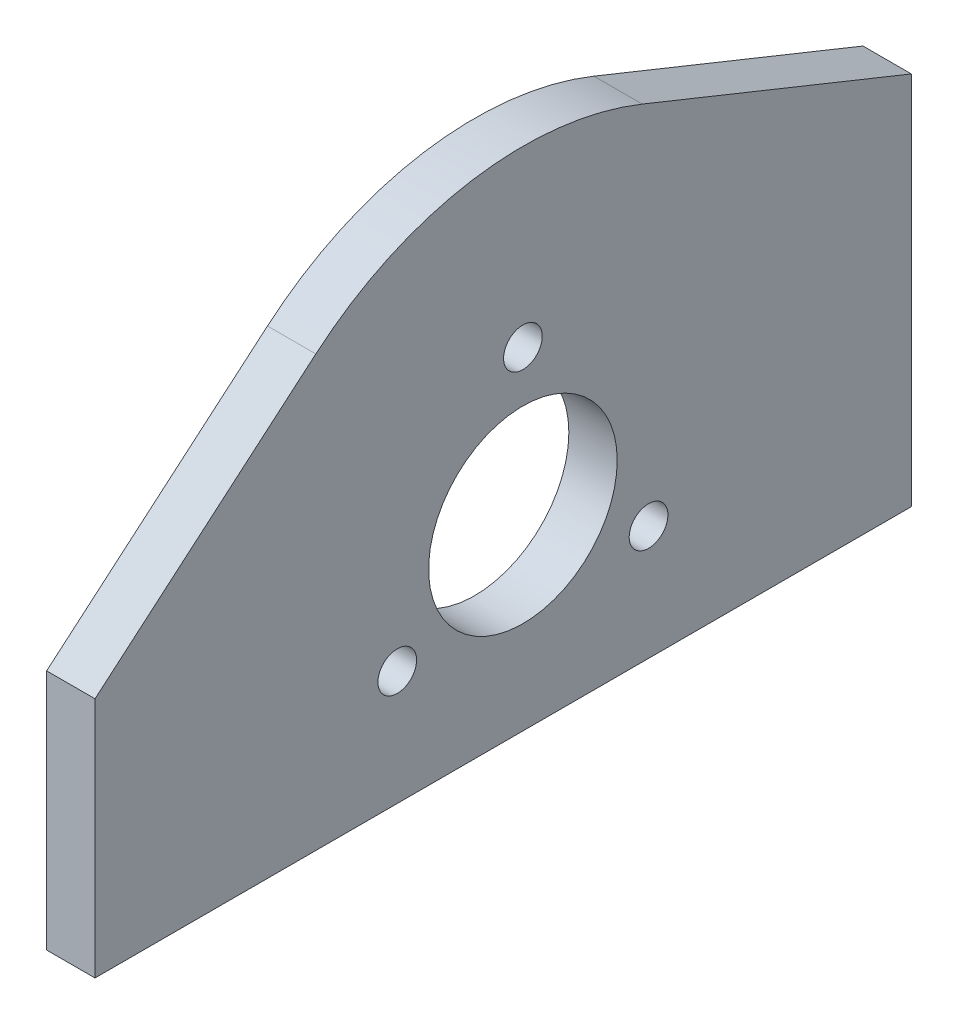
ISO-10303-21;
HEADER;
FILE_DESCRIPTION(('STEP AP214'),'2;1');
FILE_NAME('part.step','',(''),(''),'','','');
FILE_SCHEMA(('AUTOMOTIVE_DESIGN { 1 0 10303 214 1 1 1 1 }'));
ENDSEC;
DATA;
#1=APPLICATION_CONTEXT('core data for automotive mechanical design processes');
#2=APPLICATION_PROTOCOL_DEFINITION('international standard','automotive_design',2000,#1);
#3=PRODUCT_CONTEXT('',#1,'mechanical');
#4=PRODUCT('Part','Part','',(#3));
#5=PRODUCT_RELATED_PRODUCT_CATEGORY('part','',(#4));
#6=PRODUCT_DEFINITION_FORMATION('','',#4);
#7=PRODUCT_DEFINITION_CONTEXT('part definition',#1,'design');
#8=PRODUCT_DEFINITION('design','',#6,#7);
#9=PRODUCT_DEFINITION_SHAPE('','',#8);
#10=(LENGTH_UNIT() NAMED_UNIT(*) SI_UNIT(.MILLI.,.METRE.));
#11=(NAMED_UNIT(*) PLANE_ANGLE_UNIT() SI_UNIT($,.RADIAN.));
#12=(NAMED_UNIT(*) SI_UNIT($,.STERADIAN.) SOLID_ANGLE_UNIT());
#13=UNCERTAINTY_MEASURE_WITH_UNIT(LENGTH_MEASURE(1.E-05),#10,'distance_accuracy_value','');
#14=(GEOMETRIC_REPRESENTATION_CONTEXT(3) GLOBAL_UNCERTAINTY_ASSIGNED_CONTEXT((#13)) GLOBAL_UNIT_ASSIGNED_CONTEXT((#10,
#11,#12)) REPRESENTATION_CONTEXT('',''));
#15=CARTESIAN_POINT('',(0.,0.,0.));
#16=DIRECTION('',(0.,0.,1.));
#17=DIRECTION('',(1.,0.,0.));
#18=AXIS2_PLACEMENT_3D('',#15,#16,#17);
#19=CARTESIAN_POINT('',(5.,81.,0.));
#20=DIRECTION('',(-1.,0.,0.));
#21=DIRECTION('',(0.,0.,1.));
#22=AXIS2_PLACEMENT_3D('',#19,#20,#21);
#23=CYLINDRICAL_SURFACE('',#22,33.);
#24=CARTESIAN_POINT('',(0.,81.,0.));
#25=DIRECTION('',(1.,0.,0.));
#26=DIRECTION('',(0.,0.,-1.));
#27=AXIS2_PLACEMENT_3D('',#24,#25,#26);
#28=CIRCLE('',#27,33.);
#29=CARTESIAN_POINT('',(0.,111.608123513055,-12.3346169380967));
#30=VERTEX_POINT('',#29);
#31=CARTESIAN_POINT('',(0.,106.111358555441,21.4107372946394));
#32=VERTEX_POINT('',#31);
#33=EDGE_CURVE('E119',#30,#32,#28,.T.);
#34=ORIENTED_EDGE('',*,*,#33,.T.);
#35=DIRECTION('',(-1.,0.,0.));
#36=VECTOR('',#35,1.);
#37=CARTESIAN_POINT('',(5.,106.111358555441,21.4107372946394));
#38=LINE('',#37,#36);
#39=CARTESIAN_POINT('',(5.,106.111358555441,21.4107372946394));
#40=VERTEX_POINT('',#39);
#41=EDGE_CURVE('E11',#40,#32,#38,.T.);
#42=ORIENTED_EDGE('',*,*,#41,.F.);
#43=CARTESIAN_POINT('',(5.,81.,0.));
#44=DIRECTION('',(1.,0.,0.));
#45=DIRECTION('',(0.,0.,-1.));
#46=AXIS2_PLACEMENT_3D('',#43,#44,#45);
#47=CIRCLE('',#46,33.);
#48=CARTESIAN_POINT('',(5.,111.608123513055,-12.3346169380967));
#49=VERTEX_POINT('',#48);
#50=EDGE_CURVE('E130',#49,#40,#47,.T.);
#51=ORIENTED_EDGE('',*,*,#50,.F.);
#52=DIRECTION('',(-1.,0.,0.));
#53=VECTOR('',#52,1.);
#54=CARTESIAN_POINT('',(5.,111.608123513055,-12.3346169380967));
#55=LINE('',#54,#53);
#56=EDGE_CURVE('E115',#49,#30,#55,.T.);
#57=ORIENTED_EDGE('',*,*,#56,.T.);
#58=EDGE_LOOP('',(#34,#42,#51,#57));
#59=FACE_BOUND('',#58,.T.);
#60=ADVANCED_FACE('F35',(#59),#23,.T.);
#61=CARTESIAN_POINT('',(5.,86.6470519239509,44.2392450723134));
#62=DIRECTION('',(0.,-0.760950259255798,-0.64881022104968));
#63=DIRECTION('',(0.,0.64881022104968,-0.760950259255798));
#64=AXIS2_PLACEMENT_3D('',#61,#62,#63);
#65=PLANE('',#64);
#66=DIRECTION('',(0.,-0.64881022104968,0.760950259255798));
#67=VECTOR('',#66,1.);
#68=CARTESIAN_POINT('',(0.,86.6470519239509,44.2392450723134));
#69=LINE('',#68,#67);
#70=CARTESIAN_POINT('',(0.,86.6470519239509,44.2392450723134));
#71=VERTEX_POINT('',#70);
#72=EDGE_CURVE('E122',#32,#71,#69,.T.);
#73=ORIENTED_EDGE('',*,*,#72,.T.);
#74=DIRECTION('',(-1.,0.,0.));
#75=VECTOR('',#74,1.);
#76=CARTESIAN_POINT('',(5.,86.6470519239509,44.2392450723134));
#77=LINE('',#76,#75);
#78=CARTESIAN_POINT('',(5.,86.6470519239509,44.2392450723134));
#79=VERTEX_POINT('',#78);
#80=EDGE_CURVE('E43',#79,#71,#77,.T.);
#81=ORIENTED_EDGE('',*,*,#80,.F.);
#82=DIRECTION('',(0.,-0.64881022104968,0.760950259255798));
#83=VECTOR('',#82,1.);
#84=CARTESIAN_POINT('',(5.,86.6470519239509,44.2392450723134));
#85=LINE('',#84,#83);
#86=EDGE_CURVE('E88',#40,#79,#85,.T.);
#87=ORIENTED_EDGE('',*,*,#86,.F.);
#88=ORIENTED_EDGE('',*,*,#41,.T.);
#89=EDGE_LOOP('',(#73,#81,#87,#88));
#90=FACE_BOUND('',#89,.T.);
#91=ADVANCED_FACE('F155',(#90),#65,.F.);
#92=CARTESIAN_POINT('',(5.,86.6470519239509,44.2392450723134));
#93=DIRECTION('',(0.,0.,-1.));
#94=DIRECTION('',(0.,1.,0.));
#95=AXIS2_PLACEMENT_3D('',#92,#93,#94);
#96=PLANE('',#95);
#97=DIRECTION('',(0.,-1.,0.));
#98=VECTOR('',#97,1.);
#99=CARTESIAN_POINT('',(0.,86.6470519239509,44.2392450723134));
#100=LINE('',#99,#98);
#101=CARTESIAN_POINT('',(0.,61.6470519239509,44.2392450723133));
#102=VERTEX_POINT('',#101);
#103=EDGE_CURVE('E125',#71,#102,#100,.T.);
#104=ORIENTED_EDGE('',*,*,#103,.T.);
#105=DIRECTION('',(-1.,0.,0.));
#106=VECTOR('',#105,1.);
#107=CARTESIAN_POINT('',(5.,61.6470519239509,44.2392450723133));
#108=LINE('',#107,#106);
#109=CARTESIAN_POINT('',(5.,61.6470519239509,44.2392450723133));
#110=VERTEX_POINT('',#109);
#111=EDGE_CURVE('E110',#110,#102,#108,.T.);
#112=ORIENTED_EDGE('',*,*,#111,.F.);
#113=DIRECTION('',(0.,-1.,0.));
#114=VECTOR('',#113,1.);
#115=CARTESIAN_POINT('',(5.,86.6470519239509,44.2392450723134));
#116=LINE('',#115,#114);
#117=EDGE_CURVE('E101',#79,#110,#116,.T.);
#118=ORIENTED_EDGE('',*,*,#117,.F.);
#119=ORIENTED_EDGE('',*,*,#80,.T.);
#120=EDGE_LOOP('',(#104,#112,#118,#119));
#121=FACE_BOUND('',#120,.T.);
#122=ADVANCED_FACE('F136',(#121),#96,.F.);
#123=CARTESIAN_POINT('',(5.,61.6470519239509,44.2392450723133));
#124=DIRECTION('',(0.,1.,0.));
#125=DIRECTION('',(0.,0.,1.));
#126=AXIS2_PLACEMENT_3D('',#123,#124,#125);
#127=PLANE('',#126);
#128=DIRECTION('',(0.,0.,-1.));
#129=VECTOR('',#128,1.);
#130=CARTESIAN_POINT('',(0.,61.6470519239509,44.2392450723133));
#131=LINE('',#130,#129);
#132=CARTESIAN_POINT('',(0.,61.6470519239509,-40.1601837681464));
#133=VERTEX_POINT('',#132);
#134=EDGE_CURVE('E109',#102,#133,#131,.T.);
#135=ORIENTED_EDGE('',*,*,#134,.T.);
#136=DIRECTION('',(-1.,0.,0.));
#137=VECTOR('',#136,1.);
#138=CARTESIAN_POINT('',(5.,61.6470519239509,-40.1601837681464));
#139=LINE('',#138,#137);
#140=CARTESIAN_POINT('',(5.,61.6470519239509,-40.1601837681464));
#141=VERTEX_POINT('',#140);
#142=EDGE_CURVE('E106',#141,#133,#139,.T.);
#143=ORIENTED_EDGE('',*,*,#142,.F.);
#144=DIRECTION('',(0.,0.,-1.));
#145=VECTOR('',#144,1.);
#146=CARTESIAN_POINT('',(5.,61.6470519239509,44.2392450723133));
#147=LINE('',#146,#145);
#148=EDGE_CURVE('E95',#110,#141,#147,.T.);
#149=ORIENTED_EDGE('',*,*,#148,.F.);
#150=ORIENTED_EDGE('',*,*,#111,.T.);
#151=EDGE_LOOP('',(#135,#143,#149,#150));
#152=FACE_BOUND('',#151,.T.);
#153=ADVANCED_FACE('F107',(#152),#127,.F.);
#154=CARTESIAN_POINT('',(5.,61.6470519239509,-40.1601837681464));
#155=DIRECTION('',(0.,0.,1.));
#156=DIRECTION('',(1.,0.,0.));
#157=AXIS2_PLACEMENT_3D('',#154,#155,#156);
#158=PLANE('',#157);
#159=DIRECTION('',(0.,1.,0.));
#160=VECTOR('',#159,1.);
#161=CARTESIAN_POINT('',(0.,61.6470519239509,-40.1601837681464));
#162=LINE('',#161,#160);
#163=CARTESIAN_POINT('',(0.,100.394835387512,-40.1601837681464));
#164=VERTEX_POINT('',#163);
#165=EDGE_CURVE('E74',#133,#164,#162,.T.);
#166=ORIENTED_EDGE('',*,*,#165,.T.);
#167=DIRECTION('',(-1.,0.,0.));
#168=VECTOR('',#167,1.);
#169=CARTESIAN_POINT('',(5.,100.394835387512,-40.1601837681464));
#170=LINE('',#169,#168);
#171=CARTESIAN_POINT('',(5.,100.394835387512,-40.1601837681464));
#172=VERTEX_POINT('',#171);
#173=EDGE_CURVE('E111',#172,#164,#170,.T.);
#174=ORIENTED_EDGE('',*,*,#173,.F.);
#175=DIRECTION('',(0.,1.,0.));
#176=VECTOR('',#175,1.);
#177=CARTESIAN_POINT('',(5.,61.6470519239509,-40.1601837681464));
#178=LINE('',#177,#176);
#179=EDGE_CURVE('E99',#141,#172,#178,.T.);
#180=ORIENTED_EDGE('',*,*,#179,.F.);
#181=ORIENTED_EDGE('',*,*,#142,.T.);
#182=EDGE_LOOP('',(#166,#174,#180,#181));
#183=FACE_BOUND('',#182,.T.);
#184=ADVANCED_FACE('F113',(#183),#158,.F.);
#185=CARTESIAN_POINT('',(5.,100.394835387512,-40.1601837681464));
#186=DIRECTION('',(0.,-0.927518894334992,0.37377627085142));
#187=DIRECTION('',(0.,-0.37377627085142,-0.927518894334992));
#188=AXIS2_PLACEMENT_3D('',#185,#186,#187);
#189=PLANE('',#188);
#190=DIRECTION('',(0.,0.37377627085142,0.927518894334992));
#191=VECTOR('',#190,1.);
#192=CARTESIAN_POINT('',(0.,100.394835387512,-40.1601837681464));
#193=LINE('',#192,#191);
#194=EDGE_CURVE('E80',#164,#30,#193,.T.);
#195=ORIENTED_EDGE('',*,*,#194,.T.);
#196=ORIENTED_EDGE('',*,*,#56,.F.);
#197=DIRECTION('',(0.,0.37377627085142,0.927518894334992));
#198=VECTOR('',#197,1.);
#199=CARTESIAN_POINT('',(5.,100.394835387512,-40.1601837681464));
#200=LINE('',#199,#198);
#201=EDGE_CURVE('E51',#172,#49,#200,.T.);
#202=ORIENTED_EDGE('',*,*,#201,.F.);
#203=ORIENTED_EDGE('',*,*,#173,.T.);
#204=EDGE_LOOP('',(#195,#196,#202,#203));
#205=FACE_BOUND('',#204,.T.);
#206=ADVANCED_FACE('F143',(#205),#189,.F.);
#207=CARTESIAN_POINT('',(5.,81.,0.));
#208=DIRECTION('',(1.,0.,0.));
#209=DIRECTION('',(0.,0.,-1.));
#210=AXIS2_PLACEMENT_3D('',#207,#208,#209);
#211=PLANE('',#210);
#212=CARTESIAN_POINT('',(5.,81.,0.));
#213=DIRECTION('',(1.,0.,0.));
#214=DIRECTION('',(0.,0.,-1.));
#215=AXIS2_PLACEMENT_3D('',#212,#213,#214);
#216=CIRCLE('',#215,9.75000000000001);
#217=CARTESIAN_POINT('',(5.,81.,-9.75000000000001));
#218=VERTEX_POINT('',#217);
#219=EDGE_CURVE('E238',#218,#218,#216,.T.);
#220=ORIENTED_EDGE('',*,*,#219,.F.);
#221=EDGE_LOOP('',(#220));
#222=FACE_BOUND('',#221,.T.);
#223=CARTESIAN_POINT('',(5.,96.,0.));
#224=DIRECTION('',(1.,0.,0.));
#225=DIRECTION('',(0.,0.,-1.));
#226=AXIS2_PLACEMENT_3D('',#223,#224,#225);
#227=CIRCLE('',#226,2.);
#228=CARTESIAN_POINT('',(5.,96.,-2.));
#229=VERTEX_POINT('',#228);
#230=EDGE_CURVE('E246',#229,#229,#227,.T.);
#231=ORIENTED_EDGE('',*,*,#230,.F.);
#232=EDGE_LOOP('',(#231));
#233=FACE_BOUND('',#232,.T.);
#234=CARTESIAN_POINT('',(5.,73.4999999999999,12.9903810567665));
#235=DIRECTION('',(1.,0.,0.));
#236=DIRECTION('',(0.,0.,-1.));
#237=AXIS2_PLACEMENT_3D('',#234,#235,#236);
#238=CIRCLE('',#237,2.);
#239=CARTESIAN_POINT('',(5.,73.4999999999999,10.9903810567665));
#240=VERTEX_POINT('',#239);
#241=EDGE_CURVE('E252',#240,#240,#238,.T.);
#242=ORIENTED_EDGE('',*,*,#241,.F.);
#243=EDGE_LOOP('',(#242));
#244=FACE_BOUND('',#243,.T.);
#245=CARTESIAN_POINT('',(5.,73.5000000000001,-12.9903810567667));
#246=DIRECTION('',(1.,0.,0.));
#247=DIRECTION('',(0.,0.,-1.));
#248=AXIS2_PLACEMENT_3D('',#245,#246,#247);
#249=CIRCLE('',#248,2.00000000000001);
#250=CARTESIAN_POINT('',(5.,73.5000000000001,-14.9903810567667));
#251=VERTEX_POINT('',#250);
#252=EDGE_CURVE('E123',#251,#251,#249,.T.);
#253=ORIENTED_EDGE('',*,*,#252,.F.);
#254=EDGE_LOOP('',(#253));
#255=FACE_BOUND('',#254,.T.);
#256=ORIENTED_EDGE('',*,*,#50,.T.);
#257=ORIENTED_EDGE('',*,*,#86,.T.);
#258=ORIENTED_EDGE('',*,*,#117,.T.);
#259=ORIENTED_EDGE('',*,*,#148,.T.);
#260=ORIENTED_EDGE('',*,*,#179,.T.);
#261=ORIENTED_EDGE('',*,*,#201,.T.);
#262=EDGE_LOOP('',(#256,#257,#258,#259,#260,#261));
#263=FACE_BOUND('',#262,.T.);
#264=ADVANCED_FACE('F97',(#222,#233,#244,#255,#263),#211,.T.);
#265=CARTESIAN_POINT('',(0.,81.,0.));
#266=DIRECTION('',(1.,0.,0.));
#267=DIRECTION('',(0.,0.,-1.));
#268=AXIS2_PLACEMENT_3D('',#265,#266,#267);
#269=PLANE('',#268);
#270=CARTESIAN_POINT('',(0.,81.,0.));
#271=DIRECTION('',(1.,0.,0.));
#272=DIRECTION('',(0.,0.,-1.));
#273=AXIS2_PLACEMENT_3D('',#270,#271,#272);
#274=CIRCLE('',#273,9.75000000000001);
#275=CARTESIAN_POINT('',(0.,81.,-9.75000000000001));
#276=VERTEX_POINT('',#275);
#277=EDGE_CURVE('E241',#276,#276,#274,.T.);
#278=ORIENTED_EDGE('',*,*,#277,.T.);
#279=EDGE_LOOP('',(#278));
#280=FACE_BOUND('',#279,.T.);
#281=CARTESIAN_POINT('',(0.,96.,0.));
#282=DIRECTION('',(1.,0.,0.));
#283=DIRECTION('',(0.,0.,-1.));
#284=AXIS2_PLACEMENT_3D('',#281,#282,#283);
#285=CIRCLE('',#284,2.);
#286=CARTESIAN_POINT('',(0.,96.,-2.));
#287=VERTEX_POINT('',#286);
#288=EDGE_CURVE('E243',#287,#287,#285,.T.);
#289=ORIENTED_EDGE('',*,*,#288,.T.);
#290=EDGE_LOOP('',(#289));
#291=FACE_BOUND('',#290,.T.);
#292=CARTESIAN_POINT('',(0.,73.4999999999999,12.9903810567665));
#293=DIRECTION('',(1.,0.,0.));
#294=DIRECTION('',(0.,0.,-1.));
#295=AXIS2_PLACEMENT_3D('',#292,#293,#294);
#296=CIRCLE('',#295,2.);
#297=CARTESIAN_POINT('',(0.,73.4999999999999,10.9903810567665));
#298=VERTEX_POINT('',#297);
#299=EDGE_CURVE('E249',#298,#298,#296,.T.);
#300=ORIENTED_EDGE('',*,*,#299,.T.);
#301=EDGE_LOOP('',(#300));
#302=FACE_BOUND('',#301,.T.);
#303=CARTESIAN_POINT('',(0.,73.5000000000001,-12.9903810567667));
#304=DIRECTION('',(1.,0.,0.));
#305=DIRECTION('',(0.,0.,-1.));
#306=AXIS2_PLACEMENT_3D('',#303,#304,#305);
#307=CIRCLE('',#306,2.00000000000001);
#308=CARTESIAN_POINT('',(0.,73.5000000000001,-14.9903810567667));
#309=VERTEX_POINT('',#308);
#310=EDGE_CURVE('E255',#309,#309,#307,.T.);
#311=ORIENTED_EDGE('',*,*,#310,.T.);
#312=EDGE_LOOP('',(#311));
#313=FACE_BOUND('',#312,.T.);
#314=ORIENTED_EDGE('',*,*,#33,.F.);
#315=ORIENTED_EDGE('',*,*,#194,.F.);
#316=ORIENTED_EDGE('',*,*,#165,.F.);
#317=ORIENTED_EDGE('',*,*,#134,.F.);
#318=ORIENTED_EDGE('',*,*,#103,.F.);
#319=ORIENTED_EDGE('',*,*,#72,.F.);
#320=EDGE_LOOP('',(#314,#315,#316,#317,#318,#319));
#321=FACE_BOUND('',#320,.T.);
#322=ADVANCED_FACE('F139',(#280,#291,#302,#313,#321),#269,.F.);
#323=CARTESIAN_POINT('',(5.,73.5000000000001,-12.9903810567667));
#324=DIRECTION('',(-1.,0.,0.));
#325=DIRECTION('',(0.,0.,1.));
#326=AXIS2_PLACEMENT_3D('',#323,#324,#325);
#327=CYLINDRICAL_SURFACE('',#326,2.00000000000001);
#328=ORIENTED_EDGE('',*,*,#252,.T.);
#329=EDGE_LOOP('',(#328));
#330=FACE_BOUND('',#329,.T.);
#331=ORIENTED_EDGE('',*,*,#310,.F.);
#332=EDGE_LOOP('',(#331));
#333=FACE_BOUND('',#332,.T.);
#334=ADVANCED_FACE('F192',(#330,#333),#327,.F.);
#335=CARTESIAN_POINT('',(5.,73.4999999999999,12.9903810567665));
#336=DIRECTION('',(-1.,0.,0.));
#337=DIRECTION('',(0.,0.,1.));
#338=AXIS2_PLACEMENT_3D('',#335,#336,#337);
#339=CYLINDRICAL_SURFACE('',#338,2.);
#340=ORIENTED_EDGE('',*,*,#241,.T.);
#341=EDGE_LOOP('',(#340));
#342=FACE_BOUND('',#341,.T.);
#343=ORIENTED_EDGE('',*,*,#299,.F.);
#344=EDGE_LOOP('',(#343));
#345=FACE_BOUND('',#344,.T.);
#346=ADVANCED_FACE('F201',(#342,#345),#339,.F.);
#347=CARTESIAN_POINT('',(5.,96.,0.));
#348=DIRECTION('',(-1.,0.,0.));
#349=DIRECTION('',(0.,0.,1.));
#350=AXIS2_PLACEMENT_3D('',#347,#348,#349);
#351=CYLINDRICAL_SURFACE('',#350,2.);
#352=ORIENTED_EDGE('',*,*,#230,.T.);
#353=EDGE_LOOP('',(#352));
#354=FACE_BOUND('',#353,.T.);
#355=ORIENTED_EDGE('',*,*,#288,.F.);
#356=EDGE_LOOP('',(#355));
#357=FACE_BOUND('',#356,.T.);
#358=ADVANCED_FACE('F211',(#354,#357),#351,.F.);
#359=CARTESIAN_POINT('',(5.,81.,0.));
#360=DIRECTION('',(-1.,0.,0.));
#361=DIRECTION('',(0.,0.,1.));
#362=AXIS2_PLACEMENT_3D('',#359,#360,#361);
#363=CYLINDRICAL_SURFACE('',#362,9.75000000000001);
#364=ORIENTED_EDGE('',*,*,#219,.T.);
#365=EDGE_LOOP('',(#364));
#366=FACE_BOUND('',#365,.T.);
#367=ORIENTED_EDGE('',*,*,#277,.F.);
#368=EDGE_LOOP('',(#367));
#369=FACE_BOUND('',#368,.T.);
#370=ADVANCED_FACE('F221',(#366,#369),#363,.F.);
#371=CLOSED_SHELL('',(#60,#91,#122,#153,#184,#206,#264,#322,#334,#346,#358,#370));
#372=MANIFOLD_SOLID_BREP('B2',#371);
#373=ADVANCED_BREP_SHAPE_REPRESENTATION('',(#18,#372),#14);
#374=SHAPE_DEFINITION_REPRESENTATION(#9,#373);
ENDSEC;
END-ISO-10303-21;
